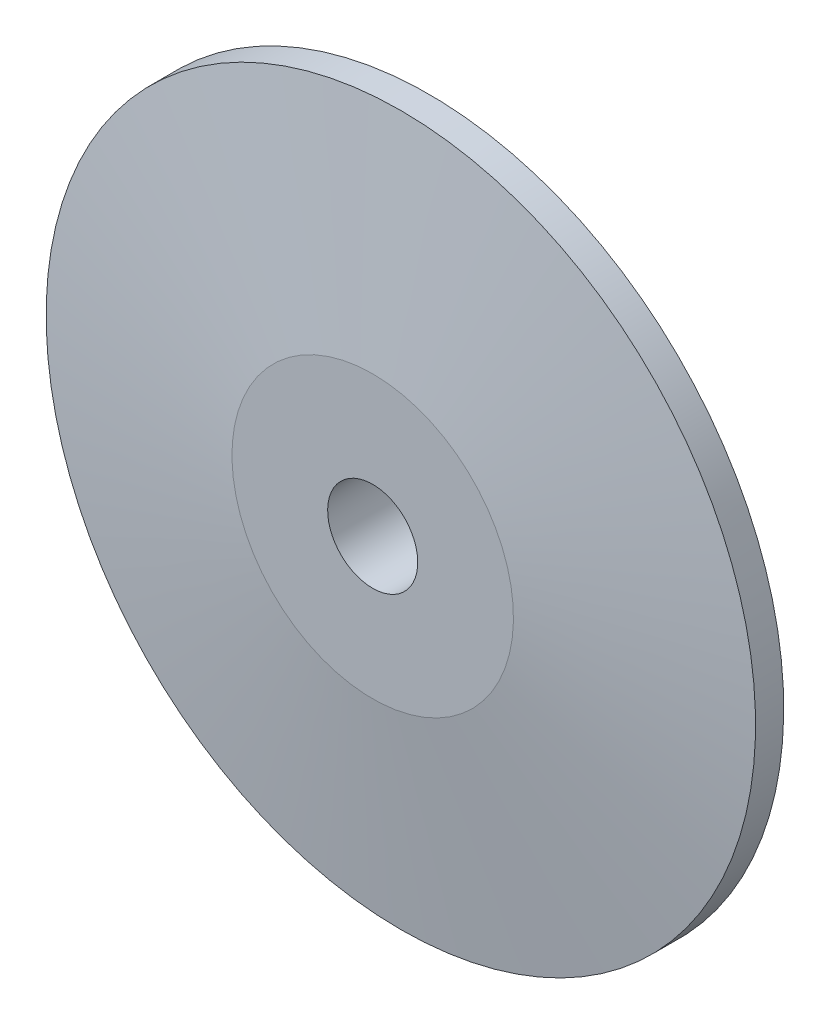
ISO-10303-21;
HEADER;
FILE_DESCRIPTION(('STEP AP214'),'2;1');
FILE_NAME('part.step','',(''),(''),'','','');
FILE_SCHEMA(('AUTOMOTIVE_DESIGN { 1 0 10303 214 1 1 1 1 }'));
ENDSEC;
DATA;
#1=APPLICATION_CONTEXT('core data for automotive mechanical design processes');
#2=APPLICATION_PROTOCOL_DEFINITION('international standard','automotive_design',2000,#1);
#3=PRODUCT_CONTEXT('',#1,'mechanical');
#4=PRODUCT('Part','Part','',(#3));
#5=PRODUCT_RELATED_PRODUCT_CATEGORY('part','',(#4));
#6=PRODUCT_DEFINITION_FORMATION('','',#4);
#7=PRODUCT_DEFINITION_CONTEXT('part definition',#1,'design');
#8=PRODUCT_DEFINITION('design','',#6,#7);
#9=PRODUCT_DEFINITION_SHAPE('','',#8);
#10=(LENGTH_UNIT() NAMED_UNIT(*) SI_UNIT(.MILLI.,.METRE.));
#11=(NAMED_UNIT(*) PLANE_ANGLE_UNIT() SI_UNIT($,.RADIAN.));
#12=(NAMED_UNIT(*) SI_UNIT($,.STERADIAN.) SOLID_ANGLE_UNIT());
#13=UNCERTAINTY_MEASURE_WITH_UNIT(LENGTH_MEASURE(1.E-05),#10,'distance_accuracy_value','');
#14=(GEOMETRIC_REPRESENTATION_CONTEXT(3) GLOBAL_UNCERTAINTY_ASSIGNED_CONTEXT((#13)) GLOBAL_UNIT_ASSIGNED_CONTEXT((#10,
#11,#12)) REPRESENTATION_CONTEXT('',''));
#15=CARTESIAN_POINT('',(0.,0.,0.));
#16=DIRECTION('',(0.,0.,1.));
#17=DIRECTION('',(1.,0.,0.));
#18=AXIS2_PLACEMENT_3D('',#15,#16,#17);
#19=CARTESIAN_POINT('',(0.,0.,0.));
#20=DIRECTION('',(0.,0.,1.));
#21=DIRECTION('',(0.,-1.,0.));
#22=AXIS2_PLACEMENT_3D('',#19,#20,#21);
#23=CYLINDRICAL_SURFACE('',#22,4.);
#24=CARTESIAN_POINT('',(0.,0.,0.));
#25=DIRECTION('',(0.,0.,-1.));
#26=DIRECTION('',(0.,1.,0.));
#27=AXIS2_PLACEMENT_3D('',#24,#25,#26);
#28=CIRCLE('',#27,4.);
#29=CARTESIAN_POINT('',(0.,4.,0.));
#30=VERTEX_POINT('',#29);
#31=EDGE_CURVE('E11',#30,#30,#28,.T.);
#32=ORIENTED_EDGE('',*,*,#31,.T.);
#33=EDGE_LOOP('',(#32));
#34=FACE_BOUND('',#33,.T.);
#35=CARTESIAN_POINT('',(0.,0.,20.));
#36=DIRECTION('',(0.,0.,-1.));
#37=DIRECTION('',(0.,1.,0.));
#38=AXIS2_PLACEMENT_3D('',#35,#36,#37);
#39=CIRCLE('',#38,4.);
#40=CARTESIAN_POINT('',(0.,-4.,20.));
#41=VERTEX_POINT('',#40);
#42=EDGE_CURVE('E87',#41,#41,#39,.T.);
#43=ORIENTED_EDGE('',*,*,#42,.F.);
#44=EDGE_LOOP('',(#43));
#45=FACE_BOUND('',#44,.T.);
#46=ADVANCED_FACE('F16',(#34,#45),#23,.F.);
#47=CARTESIAN_POINT('',(0.,0.,4.));
#48=DIRECTION('',(0.,0.,-1.));
#49=DIRECTION('',(0.,1.,0.));
#50=AXIS2_PLACEMENT_3D('',#47,#48,#49);
#51=CYLINDRICAL_SURFACE('',#50,7.5);
#52=CARTESIAN_POINT('',(0.,0.,4.));
#53=DIRECTION('',(0.,0.,-1.));
#54=DIRECTION('',(0.,1.,0.));
#55=AXIS2_PLACEMENT_3D('',#52,#53,#54);
#56=CIRCLE('',#55,7.5);
#57=CARTESIAN_POINT('',(0.,-7.5,4.));
#58=VERTEX_POINT('',#57);
#59=EDGE_CURVE('E27',#58,#58,#56,.T.);
#60=ORIENTED_EDGE('',*,*,#59,.T.);
#61=EDGE_LOOP('',(#60));
#62=FACE_BOUND('',#61,.T.);
#63=CARTESIAN_POINT('',(0.,0.,0.));
#64=DIRECTION('',(0.,0.,-1.));
#65=DIRECTION('',(0.,1.,0.));
#66=AXIS2_PLACEMENT_3D('',#63,#64,#65);
#67=CIRCLE('',#66,7.5);
#68=CARTESIAN_POINT('',(0.,7.5,0.));
#69=VERTEX_POINT('',#68);
#70=EDGE_CURVE('E97',#69,#69,#67,.T.);
#71=ORIENTED_EDGE('',*,*,#70,.F.);
#72=EDGE_LOOP('',(#71));
#73=FACE_BOUND('',#72,.T.);
#74=ADVANCED_FACE('F140',(#62,#73),#51,.T.);
#75=CARTESIAN_POINT('',(0.,0.,15.0213642611436));
#76=DIRECTION('',(0.,0.,-1.));
#77=DIRECTION('',(0.,1.,0.));
#78=AXIS2_PLACEMENT_3D('',#75,#76,#77);
#79=CONICAL_SURFACE('',#78,31.1738637185715,1.43996893072084);
#80=CARTESIAN_POINT('',(0.,0.,17.5));
#81=DIRECTION('',(0.,0.,1.));
#82=DIRECTION('',(0.,1.,0.));
#83=AXIS2_PLACEMENT_3D('',#80,#81,#82);
#84=CIRCLE('',#83,12.3362321032632);
#85=CARTESIAN_POINT('',(0.,-12.3362321032632,17.5));
#86=VERTEX_POINT('',#85);
#87=EDGE_CURVE('E132',#86,#86,#84,.T.);
#88=ORIENTED_EDGE('',*,*,#87,.T.);
#89=EDGE_LOOP('',(#88));
#90=FACE_BOUND('',#89,.T.);
#91=CARTESIAN_POINT('',(0.,0.,15.3073989609557));
#92=DIRECTION('',(0.,0.,1.));
#93=DIRECTION('',(0.,1.,0.));
#94=AXIS2_PLACEMENT_3D('',#91,#92,#93);
#95=CIRCLE('',#94,29.);
#96=CARTESIAN_POINT('',(0.,29.,15.3073989609557));
#97=VERTEX_POINT('',#96);
#98=EDGE_CURVE('E121',#97,#97,#95,.T.);
#99=ORIENTED_EDGE('',*,*,#98,.F.);
#100=EDGE_LOOP('',(#99));
#101=FACE_BOUND('',#100,.T.);
#102=ADVANCED_FACE('F159',(#90,#101),#79,.F.);
#103=CARTESIAN_POINT('',(0.,0.,15.));
#104=DIRECTION('',(0.,0.,1.));
#105=DIRECTION('',(0.,-1.,0.));
#106=AXIS2_PLACEMENT_3D('',#103,#104,#105);
#107=CYLINDRICAL_SURFACE('',#106,29.);
#108=CARTESIAN_POINT('',(0.,0.,15.));
#109=DIRECTION('',(0.,0.,-1.));
#110=DIRECTION('',(0.,1.,0.));
#111=AXIS2_PLACEMENT_3D('',#108,#109,#110);
#112=CIRCLE('',#111,29.);
#113=CARTESIAN_POINT('',(0.,29.,15.));
#114=VERTEX_POINT('',#113);
#115=EDGE_CURVE('E20',#114,#114,#112,.T.);
#116=ORIENTED_EDGE('',*,*,#115,.T.);
#117=EDGE_LOOP('',(#116));
#118=FACE_BOUND('',#117,.T.);
#119=ORIENTED_EDGE('',*,*,#98,.T.);
#120=EDGE_LOOP('',(#119));
#121=FACE_BOUND('',#120,.T.);
#122=ADVANCED_FACE('F164',(#118,#121),#107,.F.);
#123=CARTESIAN_POINT('',(0.,0.,17.5));
#124=DIRECTION('',(0.,0.,-1.));
#125=DIRECTION('',(0.,1.,0.));
#126=AXIS2_PLACEMENT_3D('',#123,#124,#125);
#127=CONICAL_SURFACE('',#126,31.5,1.43996893072084);
#128=CARTESIAN_POINT('',(0.,0.,20.));
#129=DIRECTION('',(0.,0.,1.));
#130=DIRECTION('',(0.,-1.,0.));
#131=AXIS2_PLACEMENT_3D('',#128,#129,#130);
#132=CIRCLE('',#131,12.5);
#133=CARTESIAN_POINT('',(0.,12.5,20.));
#134=VERTEX_POINT('',#133);
#135=EDGE_CURVE('E81',#134,#134,#132,.T.);
#136=ORIENTED_EDGE('',*,*,#135,.F.);
#137=EDGE_LOOP('',(#136));
#138=FACE_BOUND('',#137,.T.);
#139=CARTESIAN_POINT('',(0.,0.,17.5));
#140=DIRECTION('',(0.,0.,1.));
#141=DIRECTION('',(0.,-1.,0.));
#142=AXIS2_PLACEMENT_3D('',#139,#140,#141);
#143=CIRCLE('',#142,31.5);
#144=CARTESIAN_POINT('',(0.,31.5,17.5));
#145=VERTEX_POINT('',#144);
#146=EDGE_CURVE('E119',#145,#145,#143,.T.);
#147=ORIENTED_EDGE('',*,*,#146,.T.);
#148=EDGE_LOOP('',(#147));
#149=FACE_BOUND('',#148,.T.);
#150=ADVANCED_FACE('F82',(#138,#149),#127,.T.);
#151=CARTESIAN_POINT('',(0.,0.,15.));
#152=DIRECTION('',(0.,0.,1.));
#153=DIRECTION('',(0.,-1.,0.));
#154=AXIS2_PLACEMENT_3D('',#151,#152,#153);
#155=CYLINDRICAL_SURFACE('',#154,31.5);
#156=CARTESIAN_POINT('',(0.,0.,15.));
#157=DIRECTION('',(0.,0.,-1.));
#158=DIRECTION('',(0.,1.,0.));
#159=AXIS2_PLACEMENT_3D('',#156,#157,#158);
#160=CIRCLE('',#159,31.5);
#161=CARTESIAN_POINT('',(0.,-31.5,15.));
#162=VERTEX_POINT('',#161);
#163=EDGE_CURVE('E103',#162,#162,#160,.T.);
#164=ORIENTED_EDGE('',*,*,#163,.F.);
#165=EDGE_LOOP('',(#164));
#166=FACE_BOUND('',#165,.T.);
#167=ORIENTED_EDGE('',*,*,#146,.F.);
#168=EDGE_LOOP('',(#167));
#169=FACE_BOUND('',#168,.T.);
#170=ADVANCED_FACE('F113',(#166,#169),#155,.T.);
#171=CARTESIAN_POINT('',(0.,0.,42.6730014102411));
#172=DIRECTION('',(0.,0.,-1.));
#173=DIRECTION('',(0.,1.,0.));
#174=AXIS2_PLACEMENT_3D('',#171,#172,#173);
#175=CYLINDRICAL_SURFACE('',#174,8.9);
#176=CARTESIAN_POINT('',(0.,0.,17.5));
#177=DIRECTION('',(0.,0.,-1.));
#178=DIRECTION('',(0.,1.,0.));
#179=AXIS2_PLACEMENT_3D('',#176,#177,#178);
#180=CIRCLE('',#179,8.9);
#181=CARTESIAN_POINT('',(0.,-8.9,17.5));
#182=VERTEX_POINT('',#181);
#183=EDGE_CURVE('E93',#182,#182,#180,.T.);
#184=ORIENTED_EDGE('',*,*,#183,.T.);
#185=EDGE_LOOP('',(#184));
#186=FACE_BOUND('',#185,.T.);
#187=CARTESIAN_POINT('',(0.,0.,4.));
#188=DIRECTION('',(0.,0.,1.));
#189=DIRECTION('',(0.,1.,0.));
#190=AXIS2_PLACEMENT_3D('',#187,#188,#189);
#191=CIRCLE('',#190,8.9);
#192=CARTESIAN_POINT('',(0.,8.9,4.));
#193=VERTEX_POINT('',#192);
#194=EDGE_CURVE('E86',#193,#193,#191,.T.);
#195=ORIENTED_EDGE('',*,*,#194,.T.);
#196=EDGE_LOOP('',(#195));
#197=FACE_BOUND('',#196,.T.);
#198=ADVANCED_FACE('F116',(#186,#197),#175,.T.);
#199=CARTESIAN_POINT('',(0.,0.,20.));
#200=DIRECTION('',(0.,0.,-1.));
#201=DIRECTION('',(1.,0.,0.));
#202=AXIS2_PLACEMENT_3D('',#199,#200,#201);
#203=PLANE('',#202);
#204=ORIENTED_EDGE('',*,*,#135,.T.);
#205=EDGE_LOOP('',(#204));
#206=FACE_BOUND('',#205,.T.);
#207=ORIENTED_EDGE('',*,*,#42,.T.);
#208=EDGE_LOOP('',(#207));
#209=FACE_BOUND('',#208,.T.);
#210=ADVANCED_FACE('F167',(#206,#209),#203,.F.);
#211=CARTESIAN_POINT('',(0.,0.,0.));
#212=DIRECTION('',(0.,0.,-1.));
#213=DIRECTION('',(1.,0.,0.));
#214=AXIS2_PLACEMENT_3D('',#211,#212,#213);
#215=PLANE('',#214);
#216=ORIENTED_EDGE('',*,*,#70,.T.);
#217=EDGE_LOOP('',(#216));
#218=FACE_BOUND('',#217,.T.);
#219=ORIENTED_EDGE('',*,*,#31,.F.);
#220=EDGE_LOOP('',(#219));
#221=FACE_BOUND('',#220,.T.);
#222=ADVANCED_FACE('F171',(#218,#221),#215,.T.);
#223=CARTESIAN_POINT('',(0.,0.,15.));
#224=DIRECTION('',(0.,0.,-1.));
#225=DIRECTION('',(1.,0.,0.));
#226=AXIS2_PLACEMENT_3D('',#223,#224,#225);
#227=PLANE('',#226);
#228=ORIENTED_EDGE('',*,*,#163,.T.);
#229=EDGE_LOOP('',(#228));
#230=FACE_BOUND('',#229,.T.);
#231=ORIENTED_EDGE('',*,*,#115,.F.);
#232=EDGE_LOOP('',(#231));
#233=FACE_BOUND('',#232,.T.);
#234=ADVANCED_FACE('F110',(#230,#233),#227,.T.);
#235=CARTESIAN_POINT('',(0.,0.,17.5));
#236=DIRECTION('',(0.,0.,-1.));
#237=DIRECTION('',(1.,0.,0.));
#238=AXIS2_PLACEMENT_3D('',#235,#236,#237);
#239=PLANE('',#238);
#240=ORIENTED_EDGE('',*,*,#87,.F.);
#241=EDGE_LOOP('',(#240));
#242=FACE_BOUND('',#241,.T.);
#243=ORIENTED_EDGE('',*,*,#183,.F.);
#244=EDGE_LOOP('',(#243));
#245=FACE_BOUND('',#244,.T.);
#246=ADVANCED_FACE('F144',(#242,#245),#239,.T.);
#247=CARTESIAN_POINT('',(0.,0.,4.));
#248=DIRECTION('',(0.,0.,-1.));
#249=DIRECTION('',(1.,0.,0.));
#250=AXIS2_PLACEMENT_3D('',#247,#248,#249);
#251=PLANE('',#250);
#252=ORIENTED_EDGE('',*,*,#194,.F.);
#253=EDGE_LOOP('',(#252));
#254=FACE_BOUND('',#253,.T.);
#255=ORIENTED_EDGE('',*,*,#59,.F.);
#256=EDGE_LOOP('',(#255));
#257=FACE_BOUND('',#256,.T.);
#258=ADVANCED_FACE('F18',(#254,#257),#251,.T.);
#259=CLOSED_SHELL('',(#46,#74,#102,#122,#150,#170,#198,#210,#222,#234,#246,#258));
#260=MANIFOLD_SOLID_BREP('B1',#259);
#261=ADVANCED_BREP_SHAPE_REPRESENTATION('',(#18,#260),#14);
#262=SHAPE_DEFINITION_REPRESENTATION(#9,#261);
ENDSEC;
END-ISO-10303-21;
